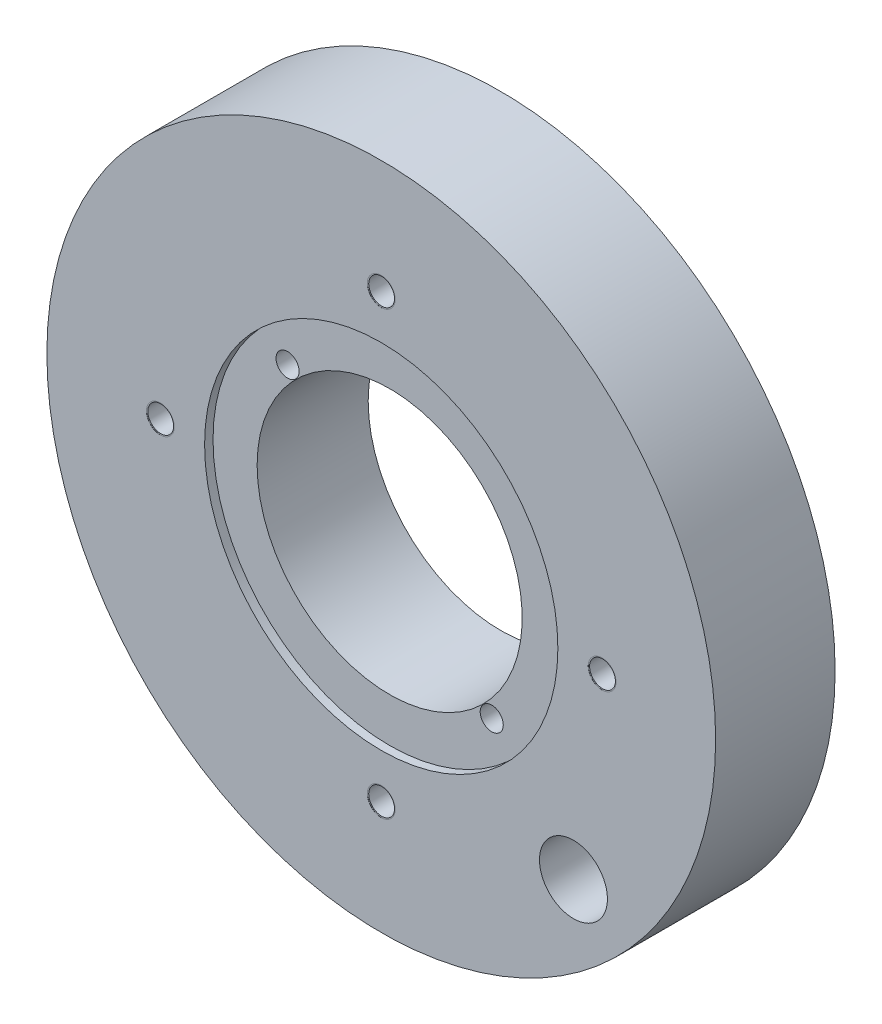
ISO-10303-21;
HEADER;
FILE_DESCRIPTION(('STEP AP214'),'2;1');
FILE_NAME('part.step','',(''),(''),'','','');
FILE_SCHEMA(('AUTOMOTIVE_DESIGN { 1 0 10303 214 1 1 1 1 }'));
ENDSEC;
DATA;
#1=APPLICATION_CONTEXT('core data for automotive mechanical design processes');
#2=APPLICATION_PROTOCOL_DEFINITION('international standard','automotive_design',2000,#1);
#3=PRODUCT_CONTEXT('',#1,'mechanical');
#4=PRODUCT('Part','Part','',(#3));
#5=PRODUCT_RELATED_PRODUCT_CATEGORY('part','',(#4));
#6=PRODUCT_DEFINITION_FORMATION('','',#4);
#7=PRODUCT_DEFINITION_CONTEXT('part definition',#1,'design');
#8=PRODUCT_DEFINITION('design','',#6,#7);
#9=PRODUCT_DEFINITION_SHAPE('','',#8);
#10=(LENGTH_UNIT() NAMED_UNIT(*) SI_UNIT(.MILLI.,.METRE.));
#11=(NAMED_UNIT(*) PLANE_ANGLE_UNIT() SI_UNIT($,.RADIAN.));
#12=(NAMED_UNIT(*) SI_UNIT($,.STERADIAN.) SOLID_ANGLE_UNIT());
#13=UNCERTAINTY_MEASURE_WITH_UNIT(LENGTH_MEASURE(1.E-05),#10,'distance_accuracy_value','');
#14=(GEOMETRIC_REPRESENTATION_CONTEXT(3) GLOBAL_UNCERTAINTY_ASSIGNED_CONTEXT((#13)) GLOBAL_UNIT_ASSIGNED_CONTEXT((#10,
#11,#12)) REPRESENTATION_CONTEXT('',''));
#15=CARTESIAN_POINT('',(0.,0.,0.));
#16=DIRECTION('',(0.,0.,1.));
#17=DIRECTION('',(1.,0.,0.));
#18=AXIS2_PLACEMENT_3D('',#15,#16,#17);
#19=CARTESIAN_POINT('',(606.622156748307,512.4143676,47.1677999998974));
#20=DIRECTION('',(0.,0.,1.));
#21=DIRECTION('',(1.,0.,0.));
#22=AXIS2_PLACEMENT_3D('',#19,#20,#21);
#23=CONICAL_SURFACE('',#22,2.41299999987055,0.785398163324384);
#24=CARTESIAN_POINT('',(606.62215674833,512.4143676,44.7547999999927));
#25=VERTEX_POINT('',#24);
#26=VERTEX_LOOP('',#25);
#27=FACE_BOUND('',#26,.T.);
#28=CARTESIAN_POINT('',(606.622156748307,512.4143676,47.1678));
#29=DIRECTION('',(0.,0.,-1.));
#30=DIRECTION('',(-1.,0.,0.));
#31=AXIS2_PLACEMENT_3D('',#28,#29,#30);
#32=CIRCLE('',#31,2.413);
#33=CARTESIAN_POINT('',(604.209156748307,512.4143676,47.1678));
#34=VERTEX_POINT('',#33);
#35=EDGE_CURVE('E49',#34,#34,#32,.F.);
#36=ORIENTED_EDGE('',*,*,#35,.T.);
#37=EDGE_LOOP('',(#36));
#38=FACE_BOUND('',#37,.T.);
#39=ADVANCED_FACE('F16',(#27,#38),#23,.F.);
#40=CARTESIAN_POINT('',(565.347182148307,471.1394946,47.1677999998974));
#41=DIRECTION('',(0.,0.,1.));
#42=DIRECTION('',(1.,0.,0.));
#43=AXIS2_PLACEMENT_3D('',#40,#41,#42);
#44=CONICAL_SURFACE('',#43,2.41299999991451,0.785398163342604);
#45=CARTESIAN_POINT('',(565.347182148307,471.139494600038,44.7547999999927));
#46=VERTEX_POINT('',#45);
#47=VERTEX_LOOP('',#46);
#48=FACE_BOUND('',#47,.T.);
#49=CARTESIAN_POINT('',(565.347182148307,471.1394946,47.1678));
#50=DIRECTION('',(0.,0.,-1.));
#51=DIRECTION('',(-1.,0.,0.));
#52=AXIS2_PLACEMENT_3D('',#49,#50,#51);
#53=CIRCLE('',#52,2.413);
#54=CARTESIAN_POINT('',(562.934182148307,471.1394946,47.1678));
#55=VERTEX_POINT('',#54);
#56=EDGE_CURVE('E51',#55,#55,#53,.F.);
#57=ORIENTED_EDGE('',*,*,#56,.T.);
#58=EDGE_LOOP('',(#57));
#59=FACE_BOUND('',#58,.T.);
#60=ADVANCED_FACE('F46',(#48,#59),#44,.F.);
#61=CARTESIAN_POINT('',(647.897029748307,471.139393,47.1677999998974));
#62=DIRECTION('',(0.,0.,1.));
#63=DIRECTION('',(1.,0.,0.));
#64=AXIS2_PLACEMENT_3D('',#61,#62,#63);
#65=CONICAL_SURFACE('',#64,2.41299999988914,0.785398163332091);
#66=CARTESIAN_POINT('',(647.897029748307,471.139392999959,44.7547999999927));
#67=VERTEX_POINT('',#66);
#68=VERTEX_LOOP('',#67);
#69=FACE_BOUND('',#68,.T.);
#70=CARTESIAN_POINT('',(647.897029748307,471.139393,47.1678));
#71=DIRECTION('',(0.,0.,-1.));
#72=DIRECTION('',(-1.,0.,0.));
#73=AXIS2_PLACEMENT_3D('',#70,#71,#72);
#74=CIRCLE('',#73,2.413);
#75=CARTESIAN_POINT('',(645.484029748307,471.139393,47.1678));
#76=VERTEX_POINT('',#75);
#77=EDGE_CURVE('E54',#76,#76,#74,.F.);
#78=ORIENTED_EDGE('',*,*,#77,.T.);
#79=EDGE_LOOP('',(#78));
#80=FACE_BOUND('',#79,.T.);
#81=ADVANCED_FACE('F263',(#69,#80),#65,.F.);
#82=CARTESIAN_POINT('',(606.622055148307,429.86452,47.1677999998974));
#83=DIRECTION('',(0.,0.,1.));
#84=DIRECTION('',(1.,0.,0.));
#85=AXIS2_PLACEMENT_3D('',#82,#83,#84);
#86=CONICAL_SURFACE('',#85,2.41299999987632,0.785398163326777);
#87=CARTESIAN_POINT('',(606.622055148279,429.86452,44.7547999999927));
#88=VERTEX_POINT('',#87);
#89=VERTEX_LOOP('',#88);
#90=FACE_BOUND('',#89,.T.);
#91=CARTESIAN_POINT('',(606.622055148307,429.86452,47.1678));
#92=DIRECTION('',(0.,0.,-1.));
#93=DIRECTION('',(-1.,0.,0.));
#94=AXIS2_PLACEMENT_3D('',#91,#92,#93);
#95=CIRCLE('',#94,2.413);
#96=CARTESIAN_POINT('',(604.209055148307,429.86452,47.1678));
#97=VERTEX_POINT('',#96);
#98=EDGE_CURVE('E120',#97,#97,#95,.F.);
#99=ORIENTED_EDGE('',*,*,#98,.T.);
#100=EDGE_LOOP('',(#99));
#101=FACE_BOUND('',#100,.T.);
#102=ADVANCED_FACE('F259',(#90,#101),#86,.F.);
#103=CARTESIAN_POINT('',(606.622156748307,512.4143676,52.6923));
#104=DIRECTION('',(0.,0.,-1.));
#105=DIRECTION('',(-1.,0.,0.));
#106=AXIS2_PLACEMENT_3D('',#103,#104,#105);
#107=CYLINDRICAL_SURFACE('',#106,2.413);
#108=CARTESIAN_POINT('',(606.622156748307,512.4143676,60.5557166666666));
#109=DIRECTION('',(0.,0.,-1.));
#110=DIRECTION('',(-1.,0.,0.));
#111=AXIS2_PLACEMENT_3D('',#108,#109,#110);
#112=CIRCLE('',#111,2.413);
#113=CARTESIAN_POINT('',(604.209156748307,512.4143676,60.5557166666666));
#114=VERTEX_POINT('',#113);
#115=EDGE_CURVE('E19',#114,#114,#112,.T.);
#116=ORIENTED_EDGE('',*,*,#115,.F.);
#117=EDGE_LOOP('',(#116));
#118=FACE_BOUND('',#117,.T.);
#119=ORIENTED_EDGE('',*,*,#35,.F.);
#120=EDGE_LOOP('',(#119));
#121=FACE_BOUND('',#120,.T.);
#122=ADVANCED_FACE('F255',(#118,#121),#107,.F.);
#123=CARTESIAN_POINT('',(565.347182148307,471.1394946,52.6923));
#124=DIRECTION('',(0.,0.,-1.));
#125=DIRECTION('',(-1.,0.,0.));
#126=AXIS2_PLACEMENT_3D('',#123,#124,#125);
#127=CYLINDRICAL_SURFACE('',#126,2.413);
#128=CARTESIAN_POINT('',(565.347182148307,471.1394946,60.5557166666666));
#129=DIRECTION('',(0.,0.,-1.));
#130=DIRECTION('',(-1.,0.,0.));
#131=AXIS2_PLACEMENT_3D('',#128,#129,#130);
#132=CIRCLE('',#131,2.413);
#133=CARTESIAN_POINT('',(562.934182148307,471.1394946,60.5557166666666));
#134=VERTEX_POINT('',#133);
#135=EDGE_CURVE('E115',#134,#134,#132,.T.);
#136=ORIENTED_EDGE('',*,*,#135,.F.);
#137=EDGE_LOOP('',(#136));
#138=FACE_BOUND('',#137,.T.);
#139=ORIENTED_EDGE('',*,*,#56,.F.);
#140=EDGE_LOOP('',(#139));
#141=FACE_BOUND('',#140,.T.);
#142=ADVANCED_FACE('F251',(#138,#141),#127,.F.);
#143=CARTESIAN_POINT('',(647.897029748307,471.139393,52.6923));
#144=DIRECTION('',(0.,0.,-1.));
#145=DIRECTION('',(-1.,0.,0.));
#146=AXIS2_PLACEMENT_3D('',#143,#144,#145);
#147=CYLINDRICAL_SURFACE('',#146,2.413);
#148=CARTESIAN_POINT('',(647.897029748307,471.139393,60.5557166666666));
#149=DIRECTION('',(0.,0.,-1.));
#150=DIRECTION('',(-1.,0.,0.));
#151=AXIS2_PLACEMENT_3D('',#148,#149,#150);
#152=CIRCLE('',#151,2.413);
#153=CARTESIAN_POINT('',(645.484029748307,471.139393,60.5557166666666));
#154=VERTEX_POINT('',#153);
#155=EDGE_CURVE('E113',#154,#154,#152,.T.);
#156=ORIENTED_EDGE('',*,*,#155,.F.);
#157=EDGE_LOOP('',(#156));
#158=FACE_BOUND('',#157,.T.);
#159=ORIENTED_EDGE('',*,*,#77,.F.);
#160=EDGE_LOOP('',(#159));
#161=FACE_BOUND('',#160,.T.);
#162=ADVANCED_FACE('F247',(#158,#161),#147,.F.);
#163=CARTESIAN_POINT('',(606.622055148307,429.86452,52.6923));
#164=DIRECTION('',(0.,0.,-1.));
#165=DIRECTION('',(-1.,0.,0.));
#166=AXIS2_PLACEMENT_3D('',#163,#164,#165);
#167=CYLINDRICAL_SURFACE('',#166,2.413);
#168=CARTESIAN_POINT('',(606.622055148307,429.86452,60.5557166666666));
#169=DIRECTION('',(0.,0.,-1.));
#170=DIRECTION('',(-1.,0.,0.));
#171=AXIS2_PLACEMENT_3D('',#168,#169,#170);
#172=CIRCLE('',#171,2.413);
#173=CARTESIAN_POINT('',(604.209055148307,429.86452,60.5557166666666));
#174=VERTEX_POINT('',#173);
#175=EDGE_CURVE('E110',#174,#174,#172,.T.);
#176=ORIENTED_EDGE('',*,*,#175,.F.);
#177=EDGE_LOOP('',(#176));
#178=FACE_BOUND('',#177,.T.);
#179=ORIENTED_EDGE('',*,*,#98,.F.);
#180=EDGE_LOOP('',(#179));
#181=FACE_BOUND('',#180,.T.);
#182=ADVANCED_FACE('F243',(#178,#181),#167,.F.);
#183=CARTESIAN_POINT('',(606.622156748307,508.618342158274,60.5557166666666));
#184=DIRECTION('',(0.,0.,1.));
#185=DIRECTION('',(1.,0.,0.));
#186=AXIS2_PLACEMENT_3D('',#183,#184,#185);
#187=PLANE('',#186);
#188=CARTESIAN_POINT('',(606.622156748307,512.4143676,60.5557166666699));
#189=DIRECTION('',(0.,0.,-1.));
#190=DIRECTION('',(-1.,0.,0.));
#191=AXIS2_PLACEMENT_3D('',#188,#189,#190);
#192=CIRCLE('',#191,2.66260394952843);
#193=CARTESIAN_POINT('',(603.959552798779,512.4143676,60.5557166666699));
#194=VERTEX_POINT('',#193);
#195=EDGE_CURVE('E107',#194,#194,#192,.F.);
#196=ORIENTED_EDGE('',*,*,#195,.T.);
#197=EDGE_LOOP('',(#196));
#198=FACE_BOUND('',#197,.T.);
#199=ORIENTED_EDGE('',*,*,#115,.T.);
#200=EDGE_LOOP('',(#199));
#201=FACE_BOUND('',#200,.T.);
#202=ADVANCED_FACE('F239',(#198,#201),#187,.T.);
#203=CARTESIAN_POINT('',(569.143207590033,471.1394946,60.5557166666666));
#204=DIRECTION('',(0.,0.,1.));
#205=DIRECTION('',(1.,0.,0.));
#206=AXIS2_PLACEMENT_3D('',#203,#204,#205);
#207=PLANE('',#206);
#208=CARTESIAN_POINT('',(565.347182148307,471.1394946,60.5557166666699));
#209=DIRECTION('',(0.,0.,-1.));
#210=DIRECTION('',(-1.,0.,0.));
#211=AXIS2_PLACEMENT_3D('',#208,#209,#210);
#212=CIRCLE('',#211,2.66260394956663);
#213=CARTESIAN_POINT('',(562.68457819874,471.1394946,60.5557166666699));
#214=VERTEX_POINT('',#213);
#215=EDGE_CURVE('E104',#214,#214,#212,.F.);
#216=ORIENTED_EDGE('',*,*,#215,.T.);
#217=EDGE_LOOP('',(#216));
#218=FACE_BOUND('',#217,.T.);
#219=ORIENTED_EDGE('',*,*,#135,.T.);
#220=EDGE_LOOP('',(#219));
#221=FACE_BOUND('',#220,.T.);
#222=ADVANCED_FACE('F235',(#218,#221),#207,.T.);
#223=CARTESIAN_POINT('',(644.101004306578,471.139393,60.5557166666666));
#224=DIRECTION('',(0.,0.,1.));
#225=DIRECTION('',(1.,0.,0.));
#226=AXIS2_PLACEMENT_3D('',#223,#224,#225);
#227=PLANE('',#226);
#228=CARTESIAN_POINT('',(647.897029748307,471.139393,60.5557166666699));
#229=DIRECTION('',(0.,0.,-1.));
#230=DIRECTION('',(-1.,0.,0.));
#231=AXIS2_PLACEMENT_3D('',#228,#229,#230);
#232=CIRCLE('',#231,2.66260394957251);
#233=CARTESIAN_POINT('',(645.234425798735,471.139393,60.5557166666699));
#234=VERTEX_POINT('',#233);
#235=EDGE_CURVE('E101',#234,#234,#232,.F.);
#236=ORIENTED_EDGE('',*,*,#235,.T.);
#237=EDGE_LOOP('',(#236));
#238=FACE_BOUND('',#237,.T.);
#239=ORIENTED_EDGE('',*,*,#155,.T.);
#240=EDGE_LOOP('',(#239));
#241=FACE_BOUND('',#240,.T.);
#242=ADVANCED_FACE('F231',(#238,#241),#227,.T.);
#243=CARTESIAN_POINT('',(606.622055148307,433.660545441729,60.5557166666666));
#244=DIRECTION('',(0.,0.,1.));
#245=DIRECTION('',(1.,0.,0.));
#246=AXIS2_PLACEMENT_3D('',#243,#244,#245);
#247=PLANE('',#246);
#248=CARTESIAN_POINT('',(606.622055148307,429.86452,60.5557166666699));
#249=DIRECTION('',(0.,0.,-1.));
#250=DIRECTION('',(-1.,0.,0.));
#251=AXIS2_PLACEMENT_3D('',#248,#249,#250);
#252=CIRCLE('',#251,2.6626039495538);
#253=CARTESIAN_POINT('',(603.959451198753,429.86452,60.5557166666699));
#254=VERTEX_POINT('',#253);
#255=EDGE_CURVE('E97',#254,#254,#252,.F.);
#256=ORIENTED_EDGE('',*,*,#255,.T.);
#257=EDGE_LOOP('',(#256));
#258=FACE_BOUND('',#257,.T.);
#259=ORIENTED_EDGE('',*,*,#175,.T.);
#260=EDGE_LOOP('',(#259));
#261=FACE_BOUND('',#260,.T.);
#262=ADVANCED_FACE('F227',(#258,#261),#247,.T.);
#263=CARTESIAN_POINT('',(587.548179148307,490.2133198,55.7797673330356));
#264=DIRECTION('',(0.,0.,1.));
#265=DIRECTION('',(1.,0.,0.));
#266=AXIS2_PLACEMENT_3D('',#263,#264,#265);
#267=CONICAL_SURFACE('',#266,2.15897459985848,1.05820971357488);
#268=CARTESIAN_POINT('',(587.548179148307,490.2133198,55.77976733318));
#269=DIRECTION('',(0.,0.,1.));
#270=DIRECTION('',(0.,-1.,0.));
#271=AXIS2_PLACEMENT_3D('',#268,#269,#270);
#272=CIRCLE('',#271,2.1589746);
#273=CARTESIAN_POINT('',(587.548179148307,488.0543452,55.77976733318));
#274=VERTEX_POINT('',#273);
#275=EDGE_CURVE('E100',#274,#274,#272,.T.);
#276=ORIENTED_EDGE('',*,*,#275,.T.);
#277=EDGE_LOOP('',(#276));
#278=FACE_BOUND('',#277,.T.);
#279=CARTESIAN_POINT('',(587.548179147916,490.2133198,54.5647837329852));
#280=VERTEX_POINT('',#279);
#281=VERTEX_LOOP('',#280);
#282=FACE_BOUND('',#281,.T.);
#283=ADVANCED_FACE('F220',(#278,#282),#267,.F.);
#284=CARTESIAN_POINT('',(625.696032748307,452.0654662,55.7797673330924));
#285=DIRECTION('',(0.,0.,1.));
#286=DIRECTION('',(0.,-1.,0.));
#287=AXIS2_PLACEMENT_3D('',#284,#285,#286);
#288=CONICAL_SURFACE('',#287,2.1589745998527,1.05820971357259);
#289=CARTESIAN_POINT('',(625.696032748307,452.0654662,55.77976733318));
#290=DIRECTION('',(0.,0.,1.));
#291=DIRECTION('',(0.,-1.,0.));
#292=AXIS2_PLACEMENT_3D('',#289,#290,#291);
#293=CIRCLE('',#292,2.1589746);
#294=CARTESIAN_POINT('',(625.696032748307,449.9064916,55.77976733318));
#295=VERTEX_POINT('',#294);
#296=EDGE_CURVE('E96',#295,#295,#293,.T.);
#297=ORIENTED_EDGE('',*,*,#296,.T.);
#298=EDGE_LOOP('',(#297));
#299=FACE_BOUND('',#298,.T.);
#300=CARTESIAN_POINT('',(625.696032748222,452.0654662,54.5647837329852));
#301=VERTEX_POINT('',#300);
#302=VERTEX_LOOP('',#301);
#303=FACE_BOUND('',#302,.T.);
#304=ADVANCED_FACE('F134',(#299,#303),#288,.F.);
#305=CARTESIAN_POINT('',(606.622156748307,512.4143676,60.5557166667836));
#306=DIRECTION('',(0.,0.,-1.));
#307=DIRECTION('',(-1.,0.,0.));
#308=AXIS2_PLACEMENT_3D('',#305,#306,#307);
#309=CONICAL_SURFACE('',#308,2.66260394943008,0.713238230838794);
#310=ORIENTED_EDGE('',*,*,#195,.F.);
#311=EDGE_LOOP('',(#310));
#312=FACE_BOUND('',#311,.T.);
#313=CARTESIAN_POINT('',(606.622156748307,512.4143676,60.6298000000152));
#314=DIRECTION('',(0.,0.,-1.));
#315=DIRECTION('',(-1.,0.,0.));
#316=AXIS2_PLACEMENT_3D('',#313,#314,#315);
#317=CIRCLE('',#316,2.59850890141144);
#318=CARTESIAN_POINT('',(604.023647846896,512.4143676,60.6298000000152));
#319=VERTEX_POINT('',#318);
#320=EDGE_CURVE('E93',#319,#319,#317,.T.);
#321=ORIENTED_EDGE('',*,*,#320,.F.);
#322=EDGE_LOOP('',(#321));
#323=FACE_BOUND('',#322,.T.);
#324=ADVANCED_FACE('F209',(#312,#323),#309,.F.);
#325=CARTESIAN_POINT('',(565.347182148307,471.1394946,60.5557166667836));
#326=DIRECTION('',(0.,0.,-1.));
#327=DIRECTION('',(-1.,0.,0.));
#328=AXIS2_PLACEMENT_3D('',#325,#326,#327);
#329=CONICAL_SURFACE('',#328,2.66260394946827,0.713238230838794);
#330=ORIENTED_EDGE('',*,*,#215,.F.);
#331=EDGE_LOOP('',(#330));
#332=FACE_BOUND('',#331,.T.);
#333=CARTESIAN_POINT('',(565.347182148307,471.1394946,60.6298000000152));
#334=DIRECTION('',(0.,0.,-1.));
#335=DIRECTION('',(-1.,0.,0.));
#336=AXIS2_PLACEMENT_3D('',#333,#334,#335);
#337=CIRCLE('',#336,2.59850890144963);
#338=CARTESIAN_POINT('',(562.748673246857,471.1394946,60.6298000000152));
#339=VERTEX_POINT('',#338);
#340=EDGE_CURVE('E90',#339,#339,#337,.T.);
#341=ORIENTED_EDGE('',*,*,#340,.F.);
#342=EDGE_LOOP('',(#341));
#343=FACE_BOUND('',#342,.T.);
#344=ADVANCED_FACE('F211',(#332,#343),#329,.F.);
#345=CARTESIAN_POINT('',(647.897029748307,471.139393,60.5557166667836));
#346=DIRECTION('',(0.,0.,-1.));
#347=DIRECTION('',(-1.,0.,0.));
#348=AXIS2_PLACEMENT_3D('',#345,#346,#347);
#349=CONICAL_SURFACE('',#348,2.66260394947415,0.713238230838794);
#350=ORIENTED_EDGE('',*,*,#235,.F.);
#351=EDGE_LOOP('',(#350));
#352=FACE_BOUND('',#351,.T.);
#353=CARTESIAN_POINT('',(647.897029748307,471.139393,60.6298000000152));
#354=DIRECTION('',(0.,0.,-1.));
#355=DIRECTION('',(-1.,0.,0.));
#356=AXIS2_PLACEMENT_3D('',#353,#354,#355);
#357=CIRCLE('',#356,2.59850890145551);
#358=CARTESIAN_POINT('',(645.298520846852,471.139393,60.6298000000152));
#359=VERTEX_POINT('',#358);
#360=EDGE_CURVE('E87',#359,#359,#357,.T.);
#361=ORIENTED_EDGE('',*,*,#360,.F.);
#362=EDGE_LOOP('',(#361));
#363=FACE_BOUND('',#362,.T.);
#364=ADVANCED_FACE('F161',(#352,#363),#349,.F.);
#365=CARTESIAN_POINT('',(606.622055148307,429.86452,60.5557166667836));
#366=DIRECTION('',(0.,0.,-1.));
#367=DIRECTION('',(-1.,0.,0.));
#368=AXIS2_PLACEMENT_3D('',#365,#366,#367);
#369=CONICAL_SURFACE('',#368,2.66260394945544,0.713238230838794);
#370=ORIENTED_EDGE('',*,*,#255,.F.);
#371=EDGE_LOOP('',(#370));
#372=FACE_BOUND('',#371,.T.);
#373=CARTESIAN_POINT('',(606.622055148307,429.86452,60.6298000000152));
#374=DIRECTION('',(0.,0.,-1.));
#375=DIRECTION('',(-1.,0.,0.));
#376=AXIS2_PLACEMENT_3D('',#373,#374,#375);
#377=CIRCLE('',#376,2.59850890143681);
#378=CARTESIAN_POINT('',(604.02354624687,429.86452,60.6298000000152));
#379=VERTEX_POINT('',#378);
#380=EDGE_CURVE('E84',#379,#379,#377,.T.);
#381=ORIENTED_EDGE('',*,*,#380,.F.);
#382=EDGE_LOOP('',(#381));
#383=FACE_BOUND('',#382,.T.);
#384=ADVANCED_FACE('F154',(#372,#383),#369,.F.);
#385=CARTESIAN_POINT('',(587.548179148307,490.2133198,59.44477143318));
#386=DIRECTION('',(0.,0.,1.));
#387=DIRECTION('',(0.,-1.,0.));
#388=AXIS2_PLACEMENT_3D('',#385,#386,#387);
#389=CYLINDRICAL_SURFACE('',#388,2.1589746);
#390=ORIENTED_EDGE('',*,*,#275,.F.);
#391=EDGE_LOOP('',(#390));
#392=FACE_BOUND('',#391,.T.);
#393=CARTESIAN_POINT('',(587.548179148307,490.2133198,59.055));
#394=DIRECTION('',(0.,0.,1.));
#395=DIRECTION('',(0.,-1.,0.));
#396=AXIS2_PLACEMENT_3D('',#393,#394,#395);
#397=CIRCLE('',#396,2.1589746);
#398=CARTESIAN_POINT('',(587.548179148307,488.0543452,59.055));
#399=VERTEX_POINT('',#398);
#400=EDGE_CURVE('E78',#399,#399,#397,.F.);
#401=ORIENTED_EDGE('',*,*,#400,.F.);
#402=EDGE_LOOP('',(#401));
#403=FACE_BOUND('',#402,.T.);
#404=ADVANCED_FACE('F140',(#392,#403),#389,.F.);
#405=CARTESIAN_POINT('',(625.696032748307,452.0654662,59.44477143318));
#406=DIRECTION('',(0.,0.,1.));
#407=DIRECTION('',(0.,-1.,0.));
#408=AXIS2_PLACEMENT_3D('',#405,#406,#407);
#409=CYLINDRICAL_SURFACE('',#408,2.1589746);
#410=ORIENTED_EDGE('',*,*,#296,.F.);
#411=EDGE_LOOP('',(#410));
#412=FACE_BOUND('',#411,.T.);
#413=CARTESIAN_POINT('',(625.696032748307,452.0654662,59.055));
#414=DIRECTION('',(0.,0.,1.));
#415=DIRECTION('',(0.,-1.,0.));
#416=AXIS2_PLACEMENT_3D('',#413,#414,#415);
#417=CIRCLE('',#416,2.1589746);
#418=CARTESIAN_POINT('',(625.696032748307,449.9064916,59.055));
#419=VERTEX_POINT('',#418);
#420=EDGE_CURVE('E75',#419,#419,#417,.F.);
#421=ORIENTED_EDGE('',*,*,#420,.F.);
#422=EDGE_LOOP('',(#421));
#423=FACE_BOUND('',#422,.T.);
#424=ADVANCED_FACE('F136',(#412,#423),#409,.F.);
#425=CARTESIAN_POINT('',(606.622156748307,471.1393676,60.6298));
#426=DIRECTION('',(0.,0.,1.));
#427=DIRECTION('',(1.,0.,0.));
#428=AXIS2_PLACEMENT_3D('',#425,#426,#427);
#429=CYLINDRICAL_SURFACE('',#428,33.0073);
#430=CARTESIAN_POINT('',(606.622156748307,471.1393676,59.055));
#431=DIRECTION('',(0.,0.,1.));
#432=DIRECTION('',(1.,0.,0.));
#433=AXIS2_PLACEMENT_3D('',#430,#431,#432);
#434=CIRCLE('',#433,33.0073);
#435=CARTESIAN_POINT('',(639.629456748307,471.1393676,59.055));
#436=VERTEX_POINT('',#435);
#437=EDGE_CURVE('E72',#436,#436,#434,.T.);
#438=ORIENTED_EDGE('',*,*,#437,.F.);
#439=EDGE_LOOP('',(#438));
#440=FACE_BOUND('',#439,.T.);
#441=CARTESIAN_POINT('',(606.622156748307,471.1393676,60.6298));
#442=DIRECTION('',(0.,0.,1.));
#443=DIRECTION('',(1.,0.,0.));
#444=AXIS2_PLACEMENT_3D('',#441,#442,#443);
#445=CIRCLE('',#444,33.0073);
#446=CARTESIAN_POINT('',(639.629456748307,471.1393676,60.6298));
#447=VERTEX_POINT('',#446);
#448=EDGE_CURVE('E81',#447,#447,#445,.F.);
#449=ORIENTED_EDGE('',*,*,#448,.F.);
#450=EDGE_LOOP('',(#449));
#451=FACE_BOUND('',#450,.T.);
#452=ADVANCED_FACE('F139',(#440,#451),#429,.F.);
#453=CARTESIAN_POINT('',(667.747358348307,471.1393168,60.6298));
#454=DIRECTION('',(0.,0.,1.));
#455=DIRECTION('',(1.,0.,0.));
#456=AXIS2_PLACEMENT_3D('',#453,#454,#455);
#457=PLANE('',#456);
#458=ORIENTED_EDGE('',*,*,#448,.T.);
#459=EDGE_LOOP('',(#458));
#460=FACE_BOUND('',#459,.T.);
#461=CARTESIAN_POINT('',(642.543192348307,435.2183066,60.6298));
#462=DIRECTION('',(0.,0.,1.));
#463=DIRECTION('',(1.,0.,0.));
#464=AXIS2_PLACEMENT_3D('',#461,#462,#463);
#465=CIRCLE('',#464,6.34997460000003);
#466=CARTESIAN_POINT('',(648.893166948307,435.2183066,60.6298));
#467=VERTEX_POINT('',#466);
#468=EDGE_CURVE('E66',#467,#467,#465,.F.);
#469=ORIENTED_EDGE('',*,*,#468,.T.);
#470=EDGE_LOOP('',(#469));
#471=FACE_BOUND('',#470,.T.);
#472=ORIENTED_EDGE('',*,*,#380,.T.);
#473=EDGE_LOOP('',(#472));
#474=FACE_BOUND('',#473,.T.);
#475=ORIENTED_EDGE('',*,*,#360,.T.);
#476=EDGE_LOOP('',(#475));
#477=FACE_BOUND('',#476,.T.);
#478=ORIENTED_EDGE('',*,*,#340,.T.);
#479=EDGE_LOOP('',(#478));
#480=FACE_BOUND('',#479,.T.);
#481=ORIENTED_EDGE('',*,*,#320,.T.);
#482=EDGE_LOOP('',(#481));
#483=FACE_BOUND('',#482,.T.);
#484=CARTESIAN_POINT('',(606.6282,471.1393168,60.6298));
#485=DIRECTION('',(0.,0.,1.));
#486=DIRECTION('',(1.,0.,0.));
#487=AXIS2_PLACEMENT_3D('',#484,#485,#486);
#488=CIRCLE('',#487,62.484);
#489=CARTESIAN_POINT('',(669.1122,471.1393168,60.6298));
#490=VERTEX_POINT('',#489);
#491=EDGE_CURVE('E69',#490,#490,#488,.F.);
#492=ORIENTED_EDGE('',*,*,#491,.F.);
#493=EDGE_LOOP('',(#492));
#494=FACE_BOUND('',#493,.T.);
#495=ADVANCED_FACE('F148',(#460,#471,#474,#477,#480,#483,#494),#457,.T.);
#496=CARTESIAN_POINT('',(639.629456748307,471.1393676,59.055));
#497=DIRECTION('',(0.,0.,1.));
#498=DIRECTION('',(1.,0.,0.));
#499=AXIS2_PLACEMENT_3D('',#496,#497,#498);
#500=PLANE('',#499);
#501=ORIENTED_EDGE('',*,*,#437,.T.);
#502=EDGE_LOOP('',(#501));
#503=FACE_BOUND('',#502,.T.);
#504=CARTESIAN_POINT('',(606.622156748307,471.139393,59.055));
#505=DIRECTION('',(0.,0.,-1.));
#506=DIRECTION('',(-1.,0.,0.));
#507=AXIS2_PLACEMENT_3D('',#504,#505,#506);
#508=CIRCLE('',#507,24.7649238000521);
#509=CARTESIAN_POINT('',(581.857232948255,471.139393,59.055));
#510=VERTEX_POINT('',#509);
#511=EDGE_CURVE('E63',#510,#510,#508,.T.);
#512=ORIENTED_EDGE('',*,*,#511,.T.);
#513=EDGE_LOOP('',(#512));
#514=FACE_BOUND('',#513,.T.);
#515=ORIENTED_EDGE('',*,*,#420,.T.);
#516=EDGE_LOOP('',(#515));
#517=FACE_BOUND('',#516,.T.);
#518=ORIENTED_EDGE('',*,*,#400,.T.);
#519=EDGE_LOOP('',(#518));
#520=FACE_BOUND('',#519,.T.);
#521=ADVANCED_FACE('F144',(#503,#514,#517,#520),#500,.T.);
#522=CARTESIAN_POINT('',(606.6282,471.1393168,60.6298));
#523=DIRECTION('',(0.,0.,1.));
#524=DIRECTION('',(1.,0.,0.));
#525=AXIS2_PLACEMENT_3D('',#522,#523,#524);
#526=CYLINDRICAL_SURFACE('',#525,62.484);
#527=CARTESIAN_POINT('',(606.6282,471.1393168,38.3032));
#528=DIRECTION('',(0.,0.,1.));
#529=DIRECTION('',(1.,0.,0.));
#530=AXIS2_PLACEMENT_3D('',#527,#528,#529);
#531=CIRCLE('',#530,62.484);
#532=CARTESIAN_POINT('',(669.1122,471.1393168,38.3032));
#533=VERTEX_POINT('',#532);
#534=EDGE_CURVE('E60',#533,#533,#531,.T.);
#535=ORIENTED_EDGE('',*,*,#534,.T.);
#536=EDGE_LOOP('',(#535));
#537=FACE_BOUND('',#536,.T.);
#538=ORIENTED_EDGE('',*,*,#491,.T.);
#539=EDGE_LOOP('',(#538));
#540=FACE_BOUND('',#539,.T.);
#541=ADVANCED_FACE('F147',(#537,#540),#526,.T.);
#542=CARTESIAN_POINT('',(642.543192348307,435.2183066,60.6298));
#543=DIRECTION('',(0.,0.,1.));
#544=DIRECTION('',(1.,0.,0.));
#545=AXIS2_PLACEMENT_3D('',#542,#543,#544);
#546=CYLINDRICAL_SURFACE('',#545,6.34997460000003);
#547=ORIENTED_EDGE('',*,*,#468,.F.);
#548=EDGE_LOOP('',(#547));
#549=FACE_BOUND('',#548,.T.);
#550=CARTESIAN_POINT('',(642.543192348307,435.2183066,38.3032));
#551=DIRECTION('',(0.,0.,1.));
#552=DIRECTION('',(1.,0.,0.));
#553=AXIS2_PLACEMENT_3D('',#550,#551,#552);
#554=CIRCLE('',#553,6.34997460000003);
#555=CARTESIAN_POINT('',(648.893166948307,435.2183066,38.3032));
#556=VERTEX_POINT('',#555);
#557=EDGE_CURVE('E25',#556,#556,#554,.F.);
#558=ORIENTED_EDGE('',*,*,#557,.T.);
#559=EDGE_LOOP('',(#558));
#560=FACE_BOUND('',#559,.T.);
#561=ADVANCED_FACE('F173',(#549,#560),#546,.F.);
#562=CARTESIAN_POINT('',(606.622156748307,471.139393,0.50799999999999));
#563=DIRECTION('',(0.,0.,-1.));
#564=DIRECTION('',(-1.,0.,0.));
#565=AXIS2_PLACEMENT_3D('',#562,#563,#564);
#566=CYLINDRICAL_SURFACE('',#565,24.7649238000521);
#567=CARTESIAN_POINT('',(606.622156748307,471.139393,38.3032));
#568=DIRECTION('',(0.,0.,-1.));
#569=DIRECTION('',(-1.,0.,0.));
#570=AXIS2_PLACEMENT_3D('',#567,#568,#569);
#571=CIRCLE('',#570,24.7649238000521);
#572=CARTESIAN_POINT('',(581.857232948255,471.139393,38.3032));
#573=VERTEX_POINT('',#572);
#574=EDGE_CURVE('E11',#573,#573,#571,.T.);
#575=ORIENTED_EDGE('',*,*,#574,.T.);
#576=EDGE_LOOP('',(#575));
#577=FACE_BOUND('',#576,.T.);
#578=ORIENTED_EDGE('',*,*,#511,.F.);
#579=EDGE_LOOP('',(#578));
#580=FACE_BOUND('',#579,.T.);
#581=ADVANCED_FACE('F167',(#577,#580),#566,.F.);
#582=CARTESIAN_POINT('',(606.622207548307,471.1393168,38.3032));
#583=DIRECTION('',(0.,0.,1.));
#584=DIRECTION('',(1.,0.,0.));
#585=AXIS2_PLACEMENT_3D('',#582,#583,#584);
#586=PLANE('',#585);
#587=ORIENTED_EDGE('',*,*,#574,.F.);
#588=EDGE_LOOP('',(#587));
#589=FACE_BOUND('',#588,.T.);
#590=ORIENTED_EDGE('',*,*,#557,.F.);
#591=EDGE_LOOP('',(#590));
#592=FACE_BOUND('',#591,.T.);
#593=ORIENTED_EDGE('',*,*,#534,.F.);
#594=EDGE_LOOP('',(#593));
#595=FACE_BOUND('',#594,.T.);
#596=ADVANCED_FACE('F165',(#589,#592,#595),#586,.F.);
#597=CLOSED_SHELL('',(#39,#60,#81,#102,#122,#142,#162,#182,#202,#222,#242,#262,#283,#304,#324,
#344,#364,#384,#404,#424,#452,#495,#521,#541,#561,#581,#596));
#598=MANIFOLD_SOLID_BREP('B1',#597);
#599=ADVANCED_BREP_SHAPE_REPRESENTATION('',(#18,#598),#14);
#600=SHAPE_DEFINITION_REPRESENTATION(#9,#599);
ENDSEC;
END-ISO-10303-21;
